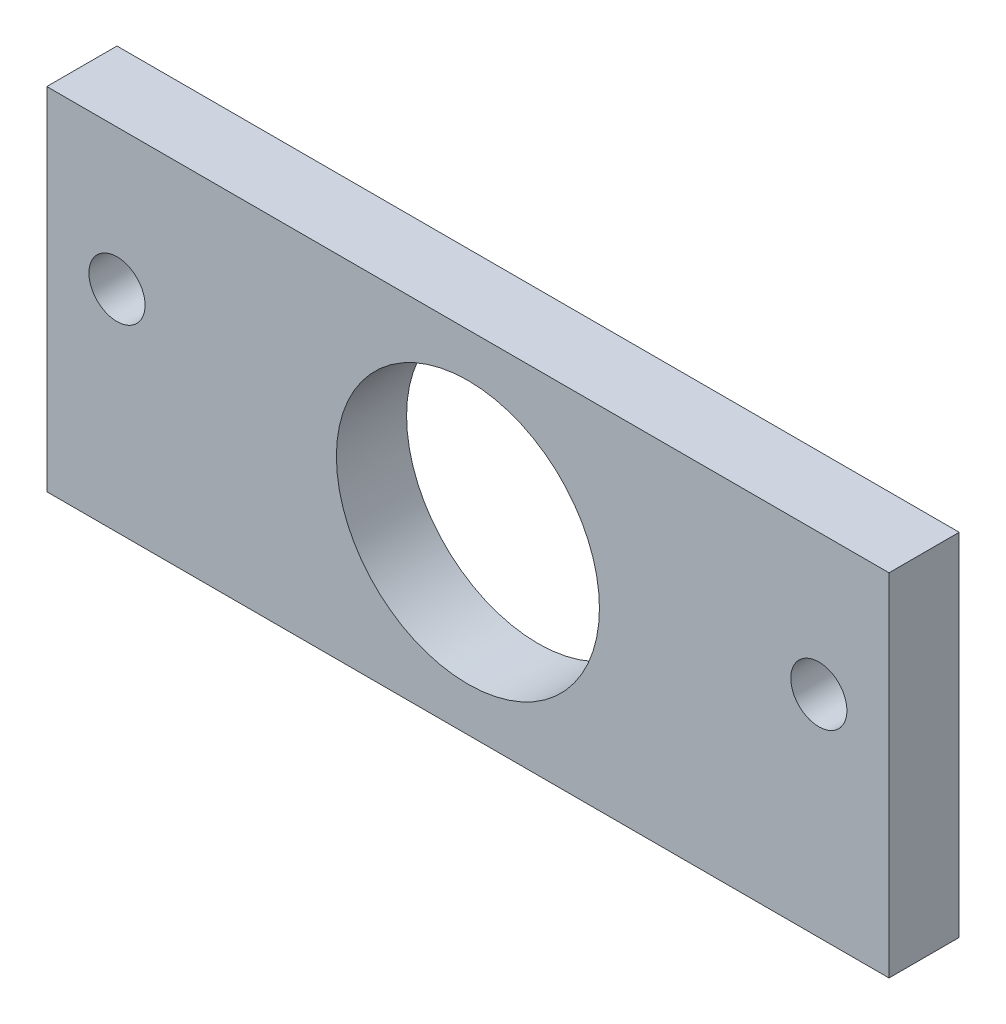
ISO-10303-21;
HEADER;
FILE_DESCRIPTION(('STEP AP214'),'2;1');
FILE_NAME('part.step','',(''),(''),'','','');
FILE_SCHEMA(('AUTOMOTIVE_DESIGN { 1 0 10303 214 1 1 1 1 }'));
ENDSEC;
DATA;
#1=APPLICATION_CONTEXT('core data for automotive mechanical design processes');
#2=APPLICATION_PROTOCOL_DEFINITION('international standard','automotive_design',2000,#1);
#3=PRODUCT_CONTEXT('',#1,'mechanical');
#4=PRODUCT('Part','Part','',(#3));
#5=PRODUCT_RELATED_PRODUCT_CATEGORY('part','',(#4));
#6=PRODUCT_DEFINITION_FORMATION('','',#4);
#7=PRODUCT_DEFINITION_CONTEXT('part definition',#1,'design');
#8=PRODUCT_DEFINITION('design','',#6,#7);
#9=PRODUCT_DEFINITION_SHAPE('','',#8);
#10=(LENGTH_UNIT() NAMED_UNIT(*) SI_UNIT(.MILLI.,.METRE.));
#11=(NAMED_UNIT(*) PLANE_ANGLE_UNIT() SI_UNIT($,.RADIAN.));
#12=(NAMED_UNIT(*) SI_UNIT($,.STERADIAN.) SOLID_ANGLE_UNIT());
#13=UNCERTAINTY_MEASURE_WITH_UNIT(LENGTH_MEASURE(1.E-05),#10,'distance_accuracy_value','');
#14=(GEOMETRIC_REPRESENTATION_CONTEXT(3) GLOBAL_UNCERTAINTY_ASSIGNED_CONTEXT((#13)) GLOBAL_UNIT_ASSIGNED_CONTEXT((#10,
#11,#12)) REPRESENTATION_CONTEXT('',''));
#15=CARTESIAN_POINT('',(0.,0.,0.));
#16=DIRECTION('',(0.,0.,1.));
#17=DIRECTION('',(1.,0.,0.));
#18=AXIS2_PLACEMENT_3D('',#15,#16,#17);
#19=CARTESIAN_POINT('',(0.,0.,6.35));
#20=DIRECTION('',(0.,0.,-1.));
#21=DIRECTION('',(-1.,0.,0.));
#22=AXIS2_PLACEMENT_3D('',#19,#20,#21);
#23=PLANE('',#22);
#24=CARTESIAN_POINT('',(6.35,19.05,6.35));
#25=DIRECTION('',(0.,0.,1.));
#26=DIRECTION('',(1.,0.,0.));
#27=AXIS2_PLACEMENT_3D('',#24,#25,#26);
#28=CIRCLE('',#27,2.54000000000001);
#29=CARTESIAN_POINT('',(8.89000000000001,19.05,6.35));
#30=VERTEX_POINT('',#29);
#31=EDGE_CURVE('E114',#30,#30,#28,.T.);
#32=ORIENTED_EDGE('',*,*,#31,.F.);
#33=EDGE_LOOP('',(#32));
#34=FACE_BOUND('',#33,.T.);
#35=DIRECTION('',(0.,-1.,0.));
#36=VECTOR('',#35,1.);
#37=CARTESIAN_POINT('',(0.,0.,6.35));
#38=LINE('',#37,#36);
#39=CARTESIAN_POINT('',(0.,31.75,6.35));
#40=VERTEX_POINT('',#39);
#41=CARTESIAN_POINT('',(0.,0.,6.35));
#42=VERTEX_POINT('',#41);
#43=EDGE_CURVE('E84',#40,#42,#38,.T.);
#44=ORIENTED_EDGE('',*,*,#43,.T.);
#45=DIRECTION('',(1.,0.,0.));
#46=VECTOR('',#45,1.);
#47=CARTESIAN_POINT('',(0.,0.,6.35));
#48=LINE('',#47,#46);
#49=CARTESIAN_POINT('',(76.2,0.,6.35));
#50=VERTEX_POINT('',#49);
#51=EDGE_CURVE('E79',#42,#50,#48,.T.);
#52=ORIENTED_EDGE('',*,*,#51,.T.);
#53=DIRECTION('',(0.,1.,0.));
#54=VECTOR('',#53,1.);
#55=CARTESIAN_POINT('',(76.2,0.,6.35));
#56=LINE('',#55,#54);
#57=CARTESIAN_POINT('',(76.2,31.75,6.35));
#58=VERTEX_POINT('',#57);
#59=EDGE_CURVE('E82',#50,#58,#56,.T.);
#60=ORIENTED_EDGE('',*,*,#59,.T.);
#61=DIRECTION('',(-1.,0.,0.));
#62=VECTOR('',#61,1.);
#63=CARTESIAN_POINT('',(0.,31.75,6.35));
#64=LINE('',#63,#62);
#65=EDGE_CURVE('E49',#58,#40,#64,.T.);
#66=ORIENTED_EDGE('',*,*,#65,.T.);
#67=EDGE_LOOP('',(#44,#52,#60,#66));
#68=FACE_BOUND('',#67,.T.);
#69=CARTESIAN_POINT('',(38.1,15.875,6.35));
#70=DIRECTION('',(0.,0.,1.));
#71=DIRECTION('',(1.,0.,0.));
#72=AXIS2_PLACEMENT_3D('',#69,#70,#71);
#73=CIRCLE('',#72,11.8999);
#74=CARTESIAN_POINT('',(49.9999,15.875,6.35));
#75=VERTEX_POINT('',#74);
#76=EDGE_CURVE('E99',#75,#75,#73,.T.);
#77=ORIENTED_EDGE('',*,*,#76,.F.);
#78=EDGE_LOOP('',(#77));
#79=FACE_BOUND('',#78,.T.);
#80=CARTESIAN_POINT('',(69.85,19.05,6.35));
#81=DIRECTION('',(0.,0.,1.));
#82=DIRECTION('',(-1.,0.,0.));
#83=AXIS2_PLACEMENT_3D('',#80,#81,#82);
#84=CIRCLE('',#83,2.54000000000001);
#85=CARTESIAN_POINT('',(67.31,19.05,6.35));
#86=VERTEX_POINT('',#85);
#87=EDGE_CURVE('E120',#86,#86,#84,.T.);
#88=ORIENTED_EDGE('',*,*,#87,.F.);
#89=EDGE_LOOP('',(#88));
#90=FACE_BOUND('',#89,.T.);
#91=ADVANCED_FACE('F32',(#34,#68,#79,#90),#23,.F.);
#92=CARTESIAN_POINT('',(0.,0.,0.));
#93=DIRECTION('',(0.,0.,-1.));
#94=DIRECTION('',(-1.,0.,0.));
#95=AXIS2_PLACEMENT_3D('',#92,#93,#94);
#96=PLANE('',#95);
#97=CARTESIAN_POINT('',(6.35,19.05,0.));
#98=DIRECTION('',(0.,0.,1.));
#99=DIRECTION('',(1.,0.,0.));
#100=AXIS2_PLACEMENT_3D('',#97,#98,#99);
#101=CIRCLE('',#100,2.54000000000001);
#102=CARTESIAN_POINT('',(8.89000000000001,19.05,0.));
#103=VERTEX_POINT('',#102);
#104=EDGE_CURVE('E117',#103,#103,#101,.T.);
#105=ORIENTED_EDGE('',*,*,#104,.T.);
#106=EDGE_LOOP('',(#105));
#107=FACE_BOUND('',#106,.T.);
#108=DIRECTION('',(0.,-1.,0.));
#109=VECTOR('',#108,1.);
#110=CARTESIAN_POINT('',(0.,0.,0.));
#111=LINE('',#110,#109);
#112=CARTESIAN_POINT('',(0.,31.75,0.));
#113=VERTEX_POINT('',#112);
#114=CARTESIAN_POINT('',(0.,0.,0.));
#115=VERTEX_POINT('',#114);
#116=EDGE_CURVE('E96',#113,#115,#111,.T.);
#117=ORIENTED_EDGE('',*,*,#116,.F.);
#118=DIRECTION('',(-1.,0.,0.));
#119=VECTOR('',#118,1.);
#120=CARTESIAN_POINT('',(0.,31.75,0.));
#121=LINE('',#120,#119);
#122=CARTESIAN_POINT('',(76.2,31.75,0.));
#123=VERTEX_POINT('',#122);
#124=EDGE_CURVE('E72',#123,#113,#121,.T.);
#125=ORIENTED_EDGE('',*,*,#124,.F.);
#126=DIRECTION('',(0.,1.,0.));
#127=VECTOR('',#126,1.);
#128=CARTESIAN_POINT('',(76.2,0.,0.));
#129=LINE('',#128,#127);
#130=CARTESIAN_POINT('',(76.2,0.,0.));
#131=VERTEX_POINT('',#130);
#132=EDGE_CURVE('E66',#131,#123,#129,.T.);
#133=ORIENTED_EDGE('',*,*,#132,.F.);
#134=DIRECTION('',(1.,0.,0.));
#135=VECTOR('',#134,1.);
#136=CARTESIAN_POINT('',(0.,0.,0.));
#137=LINE('',#136,#135);
#138=EDGE_CURVE('E88',#115,#131,#137,.T.);
#139=ORIENTED_EDGE('',*,*,#138,.F.);
#140=EDGE_LOOP('',(#117,#125,#133,#139));
#141=FACE_BOUND('',#140,.T.);
#142=CARTESIAN_POINT('',(38.1,15.875,0.));
#143=DIRECTION('',(0.,0.,1.));
#144=DIRECTION('',(1.,0.,0.));
#145=AXIS2_PLACEMENT_3D('',#142,#143,#144);
#146=CIRCLE('',#145,11.8999);
#147=CARTESIAN_POINT('',(49.9999,15.875,0.));
#148=VERTEX_POINT('',#147);
#149=EDGE_CURVE('E111',#148,#148,#146,.T.);
#150=ORIENTED_EDGE('',*,*,#149,.T.);
#151=EDGE_LOOP('',(#150));
#152=FACE_BOUND('',#151,.T.);
#153=CARTESIAN_POINT('',(69.85,19.05,0.));
#154=DIRECTION('',(0.,0.,1.));
#155=DIRECTION('',(-1.,0.,0.));
#156=AXIS2_PLACEMENT_3D('',#153,#154,#155);
#157=CIRCLE('',#156,2.54000000000001);
#158=CARTESIAN_POINT('',(67.31,19.05,0.));
#159=VERTEX_POINT('',#158);
#160=EDGE_CURVE('E123',#159,#159,#157,.T.);
#161=ORIENTED_EDGE('',*,*,#160,.T.);
#162=EDGE_LOOP('',(#161));
#163=FACE_BOUND('',#162,.T.);
#164=ADVANCED_FACE('F107',(#107,#141,#152,#163),#96,.T.);
#165=CARTESIAN_POINT('',(0.,0.,6.35));
#166=DIRECTION('',(1.,0.,0.));
#167=DIRECTION('',(0.,0.,-1.));
#168=AXIS2_PLACEMENT_3D('',#165,#166,#167);
#169=PLANE('',#168);
#170=ORIENTED_EDGE('',*,*,#116,.T.);
#171=DIRECTION('',(0.,0.,-1.));
#172=VECTOR('',#171,1.);
#173=CARTESIAN_POINT('',(0.,0.,6.35));
#174=LINE('',#173,#172);
#175=EDGE_CURVE('E11',#42,#115,#174,.T.);
#176=ORIENTED_EDGE('',*,*,#175,.F.);
#177=ORIENTED_EDGE('',*,*,#43,.F.);
#178=DIRECTION('',(0.,0.,-1.));
#179=VECTOR('',#178,1.);
#180=CARTESIAN_POINT('',(0.,31.75,6.35));
#181=LINE('',#180,#179);
#182=EDGE_CURVE('E92',#40,#113,#181,.T.);
#183=ORIENTED_EDGE('',*,*,#182,.T.);
#184=EDGE_LOOP('',(#170,#176,#177,#183));
#185=FACE_BOUND('',#184,.T.);
#186=ADVANCED_FACE('F34',(#185),#169,.F.);
#187=CARTESIAN_POINT('',(0.,0.,6.35));
#188=DIRECTION('',(0.,1.,0.));
#189=DIRECTION('',(-1.,0.,0.));
#190=AXIS2_PLACEMENT_3D('',#187,#188,#189);
#191=PLANE('',#190);
#192=ORIENTED_EDGE('',*,*,#138,.T.);
#193=DIRECTION('',(0.,0.,-1.));
#194=VECTOR('',#193,1.);
#195=CARTESIAN_POINT('',(76.2,0.,6.35));
#196=LINE('',#195,#194);
#197=EDGE_CURVE('E41',#50,#131,#196,.T.);
#198=ORIENTED_EDGE('',*,*,#197,.F.);
#199=ORIENTED_EDGE('',*,*,#51,.F.);
#200=ORIENTED_EDGE('',*,*,#175,.T.);
#201=EDGE_LOOP('',(#192,#198,#199,#200));
#202=FACE_BOUND('',#201,.T.);
#203=ADVANCED_FACE('F87',(#202),#191,.F.);
#204=CARTESIAN_POINT('',(76.2,0.,6.35));
#205=DIRECTION('',(-1.,0.,0.));
#206=DIRECTION('',(0.,-1.,0.));
#207=AXIS2_PLACEMENT_3D('',#204,#205,#206);
#208=PLANE('',#207);
#209=ORIENTED_EDGE('',*,*,#132,.T.);
#210=DIRECTION('',(0.,0.,-1.));
#211=VECTOR('',#210,1.);
#212=CARTESIAN_POINT('',(76.2,31.75,6.35));
#213=LINE('',#212,#211);
#214=EDGE_CURVE('E89',#58,#123,#213,.T.);
#215=ORIENTED_EDGE('',*,*,#214,.F.);
#216=ORIENTED_EDGE('',*,*,#59,.F.);
#217=ORIENTED_EDGE('',*,*,#197,.T.);
#218=EDGE_LOOP('',(#209,#215,#216,#217));
#219=FACE_BOUND('',#218,.T.);
#220=ADVANCED_FACE('F90',(#219),#208,.F.);
#221=CARTESIAN_POINT('',(0.,31.75,6.35));
#222=DIRECTION('',(0.,-1.,0.));
#223=DIRECTION('',(1.,0.,0.));
#224=AXIS2_PLACEMENT_3D('',#221,#222,#223);
#225=PLANE('',#224);
#226=ORIENTED_EDGE('',*,*,#124,.T.);
#227=ORIENTED_EDGE('',*,*,#182,.F.);
#228=ORIENTED_EDGE('',*,*,#65,.F.);
#229=ORIENTED_EDGE('',*,*,#214,.T.);
#230=EDGE_LOOP('',(#226,#227,#228,#229));
#231=FACE_BOUND('',#230,.T.);
#232=ADVANCED_FACE('F104',(#231),#225,.F.);
#233=CARTESIAN_POINT('',(38.1,15.875,6.35));
#234=DIRECTION('',(0.,0.,-1.));
#235=DIRECTION('',(-1.,0.,0.));
#236=AXIS2_PLACEMENT_3D('',#233,#234,#235);
#237=CYLINDRICAL_SURFACE('',#236,11.8999);
#238=ORIENTED_EDGE('',*,*,#76,.T.);
#239=EDGE_LOOP('',(#238));
#240=FACE_BOUND('',#239,.T.);
#241=ORIENTED_EDGE('',*,*,#149,.F.);
#242=EDGE_LOOP('',(#241));
#243=FACE_BOUND('',#242,.T.);
#244=ADVANCED_FACE('F142',(#240,#243),#237,.F.);
#245=CARTESIAN_POINT('',(6.35,19.05,6.35));
#246=DIRECTION('',(0.,0.,-1.));
#247=DIRECTION('',(-1.,0.,0.));
#248=AXIS2_PLACEMENT_3D('',#245,#246,#247);
#249=CYLINDRICAL_SURFACE('',#248,2.54000000000001);
#250=ORIENTED_EDGE('',*,*,#31,.T.);
#251=EDGE_LOOP('',(#250));
#252=FACE_BOUND('',#251,.T.);
#253=ORIENTED_EDGE('',*,*,#104,.F.);
#254=EDGE_LOOP('',(#253));
#255=FACE_BOUND('',#254,.T.);
#256=ADVANCED_FACE('F188',(#252,#255),#249,.F.);
#257=CARTESIAN_POINT('',(69.85,19.05,6.35));
#258=DIRECTION('',(0.,0.,-1.));
#259=DIRECTION('',(-1.,0.,0.));
#260=AXIS2_PLACEMENT_3D('',#257,#258,#259);
#261=CYLINDRICAL_SURFACE('',#260,2.54000000000001);
#262=ORIENTED_EDGE('',*,*,#87,.T.);
#263=EDGE_LOOP('',(#262));
#264=FACE_BOUND('',#263,.T.);
#265=ORIENTED_EDGE('',*,*,#160,.F.);
#266=EDGE_LOOP('',(#265));
#267=FACE_BOUND('',#266,.T.);
#268=ADVANCED_FACE('F129',(#264,#267),#261,.F.);
#269=CLOSED_SHELL('',(#91,#164,#186,#203,#220,#232,#244,#256,#268));
#270=MANIFOLD_SOLID_BREP('B2',#269);
#271=ADVANCED_BREP_SHAPE_REPRESENTATION('',(#18,#270),#14);
#272=SHAPE_DEFINITION_REPRESENTATION(#9,#271);
ENDSEC;
END-ISO-10303-21;
